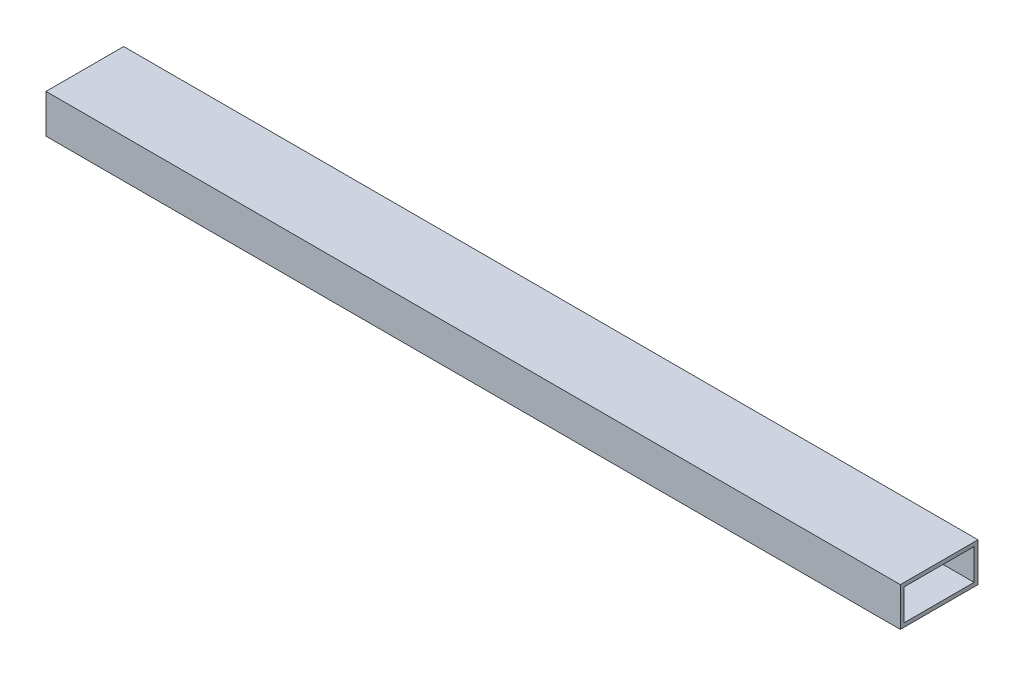
ISO-10303-21;
HEADER;
FILE_DESCRIPTION(('STEP AP214'),'2;1');
FILE_NAME('part.step','',(''),(''),'','','');
FILE_SCHEMA(('AUTOMOTIVE_DESIGN { 1 0 10303 214 1 1 1 1 }'));
ENDSEC;
DATA;
#1=APPLICATION_CONTEXT('core data for automotive mechanical design processes');
#2=APPLICATION_PROTOCOL_DEFINITION('international standard','automotive_design',2000,#1);
#3=PRODUCT_CONTEXT('',#1,'mechanical');
#4=PRODUCT('Part','Part','',(#3));
#5=PRODUCT_RELATED_PRODUCT_CATEGORY('part','',(#4));
#6=PRODUCT_DEFINITION_FORMATION('','',#4);
#7=PRODUCT_DEFINITION_CONTEXT('part definition',#1,'design');
#8=PRODUCT_DEFINITION('design','',#6,#7);
#9=PRODUCT_DEFINITION_SHAPE('','',#8);
#10=(LENGTH_UNIT() NAMED_UNIT(*) SI_UNIT(.MILLI.,.METRE.));
#11=(NAMED_UNIT(*) PLANE_ANGLE_UNIT() SI_UNIT($,.RADIAN.));
#12=(NAMED_UNIT(*) SI_UNIT($,.STERADIAN.) SOLID_ANGLE_UNIT());
#13=UNCERTAINTY_MEASURE_WITH_UNIT(LENGTH_MEASURE(1.E-05),#10,'distance_accuracy_value','');
#14=(GEOMETRIC_REPRESENTATION_CONTEXT(3) GLOBAL_UNCERTAINTY_ASSIGNED_CONTEXT((#13)) GLOBAL_UNIT_ASSIGNED_CONTEXT((#10,
#11,#12)) REPRESENTATION_CONTEXT('',''));
#15=CARTESIAN_POINT('',(0.,0.,0.));
#16=DIRECTION('',(0.,0.,1.));
#17=DIRECTION('',(1.,0.,0.));
#18=AXIS2_PLACEMENT_3D('',#15,#16,#17);
#19=CARTESIAN_POINT('',(-279.4,25.4,25.4));
#20=DIRECTION('',(1.,0.,0.));
#21=DIRECTION('',(0.,0.,-1.));
#22=AXIS2_PLACEMENT_3D('',#19,#20,#21);
#23=PLANE('',#22);
#24=DIRECTION('',(0.,0.,1.));
#25=VECTOR('',#24,1.);
#26=CARTESIAN_POINT('',(-279.4,22.86,-22.86));
#27=LINE('',#26,#25);
#28=CARTESIAN_POINT('',(-279.4,22.86,-22.86));
#29=VERTEX_POINT('',#28);
#30=CARTESIAN_POINT('',(-279.4,22.86,22.86));
#31=VERTEX_POINT('',#30);
#32=EDGE_CURVE('E105',#29,#31,#27,.T.);
#33=ORIENTED_EDGE('',*,*,#32,.T.);
#34=DIRECTION('',(0.,-1.,0.));
#35=VECTOR('',#34,1.);
#36=CARTESIAN_POINT('',(-279.4,2.53999999999999,22.86));
#37=LINE('',#36,#35);
#38=CARTESIAN_POINT('',(-279.4,2.53999999999999,22.86));
#39=VERTEX_POINT('',#38);
#40=EDGE_CURVE('E99',#31,#39,#37,.T.);
#41=ORIENTED_EDGE('',*,*,#40,.T.);
#42=DIRECTION('',(0.,0.,-1.));
#43=VECTOR('',#42,1.);
#44=CARTESIAN_POINT('',(-279.4,2.54,-22.86));
#45=LINE('',#44,#43);
#46=CARTESIAN_POINT('',(-279.4,2.54,-22.86));
#47=VERTEX_POINT('',#46);
#48=EDGE_CURVE('E108',#39,#47,#45,.T.);
#49=ORIENTED_EDGE('',*,*,#48,.T.);
#50=DIRECTION('',(0.,1.,0.));
#51=VECTOR('',#50,1.);
#52=CARTESIAN_POINT('',(-279.4,2.54,-22.86));
#53=LINE('',#52,#51);
#54=EDGE_CURVE('E47',#47,#29,#53,.T.);
#55=ORIENTED_EDGE('',*,*,#54,.T.);
#56=EDGE_LOOP('',(#33,#41,#49,#55));
#57=FACE_BOUND('',#56,.T.);
#58=DIRECTION('',(0.,0.,1.));
#59=VECTOR('',#58,1.);
#60=CARTESIAN_POINT('',(-279.4,0.,25.4));
#61=LINE('',#60,#59);
#62=CARTESIAN_POINT('',(-279.4,0.,-25.4));
#63=VERTEX_POINT('',#62);
#64=CARTESIAN_POINT('',(-279.4,0.,25.4));
#65=VERTEX_POINT('',#64);
#66=EDGE_CURVE('E129',#63,#65,#61,.T.);
#67=ORIENTED_EDGE('',*,*,#66,.T.);
#68=DIRECTION('',(0.,-1.,0.));
#69=VECTOR('',#68,1.);
#70=CARTESIAN_POINT('',(-279.4,25.4,25.4));
#71=LINE('',#70,#69);
#72=CARTESIAN_POINT('',(-279.4,25.4,25.4));
#73=VERTEX_POINT('',#72);
#74=EDGE_CURVE('E11',#73,#65,#71,.T.);
#75=ORIENTED_EDGE('',*,*,#74,.F.);
#76=DIRECTION('',(0.,0.,1.));
#77=VECTOR('',#76,1.);
#78=CARTESIAN_POINT('',(-279.4,25.4,25.4));
#79=LINE('',#78,#77);
#80=CARTESIAN_POINT('',(-279.4,25.4,-25.4));
#81=VERTEX_POINT('',#80);
#82=EDGE_CURVE('E133',#81,#73,#79,.T.);
#83=ORIENTED_EDGE('',*,*,#82,.F.);
#84=DIRECTION('',(0.,-1.,0.));
#85=VECTOR('',#84,1.);
#86=CARTESIAN_POINT('',(-279.4,25.4,-25.4));
#87=LINE('',#86,#85);
#88=EDGE_CURVE('E143',#81,#63,#87,.T.);
#89=ORIENTED_EDGE('',*,*,#88,.T.);
#90=EDGE_LOOP('',(#67,#75,#83,#89));
#91=FACE_BOUND('',#90,.T.);
#92=ADVANCED_FACE('F33',(#57,#91),#23,.F.);
#93=CARTESIAN_POINT('',(279.4,25.4,25.4));
#94=DIRECTION('',(0.,0.,-1.));
#95=DIRECTION('',(-1.,0.,0.));
#96=AXIS2_PLACEMENT_3D('',#93,#94,#95);
#97=PLANE('',#96);
#98=DIRECTION('',(1.,0.,0.));
#99=VECTOR('',#98,1.);
#100=CARTESIAN_POINT('',(279.4,0.,25.4));
#101=LINE('',#100,#99);
#102=CARTESIAN_POINT('',(279.4,0.,25.4));
#103=VERTEX_POINT('',#102);
#104=EDGE_CURVE('E146',#65,#103,#101,.T.);
#105=ORIENTED_EDGE('',*,*,#104,.T.);
#106=DIRECTION('',(0.,-1.,0.));
#107=VECTOR('',#106,1.);
#108=CARTESIAN_POINT('',(279.4,25.4,25.4));
#109=LINE('',#108,#107);
#110=CARTESIAN_POINT('',(279.4,25.4,25.4));
#111=VERTEX_POINT('',#110);
#112=EDGE_CURVE('E40',#111,#103,#109,.T.);
#113=ORIENTED_EDGE('',*,*,#112,.F.);
#114=DIRECTION('',(1.,0.,0.));
#115=VECTOR('',#114,1.);
#116=CARTESIAN_POINT('',(279.4,25.4,25.4));
#117=LINE('',#116,#115);
#118=EDGE_CURVE('E136',#73,#111,#117,.T.);
#119=ORIENTED_EDGE('',*,*,#118,.F.);
#120=ORIENTED_EDGE('',*,*,#74,.T.);
#121=EDGE_LOOP('',(#105,#113,#119,#120));
#122=FACE_BOUND('',#121,.T.);
#123=ADVANCED_FACE('F175',(#122),#97,.F.);
#124=CARTESIAN_POINT('',(279.4,25.4,25.4));
#125=DIRECTION('',(-1.,0.,0.));
#126=DIRECTION('',(0.,0.,1.));
#127=AXIS2_PLACEMENT_3D('',#124,#125,#126);
#128=PLANE('',#127);
#129=DIRECTION('',(0.,0.,-1.));
#130=VECTOR('',#129,1.);
#131=CARTESIAN_POINT('',(279.4,2.54,-22.86));
#132=LINE('',#131,#130);
#133=CARTESIAN_POINT('',(279.4,2.53999999999999,22.86));
#134=VERTEX_POINT('',#133);
#135=CARTESIAN_POINT('',(279.4,2.54,-22.86));
#136=VERTEX_POINT('',#135);
#137=EDGE_CURVE('E123',#134,#136,#132,.T.);
#138=ORIENTED_EDGE('',*,*,#137,.F.);
#139=DIRECTION('',(0.,-1.,0.));
#140=VECTOR('',#139,1.);
#141=CARTESIAN_POINT('',(279.4,2.53999999999999,22.86));
#142=LINE('',#141,#140);
#143=CARTESIAN_POINT('',(279.4,22.86,22.86));
#144=VERTEX_POINT('',#143);
#145=EDGE_CURVE('E55',#144,#134,#142,.T.);
#146=ORIENTED_EDGE('',*,*,#145,.F.);
#147=DIRECTION('',(0.,0.,1.));
#148=VECTOR('',#147,1.);
#149=CARTESIAN_POINT('',(279.4,22.86,-22.86));
#150=LINE('',#149,#148);
#151=CARTESIAN_POINT('',(279.4,22.86,-22.86));
#152=VERTEX_POINT('',#151);
#153=EDGE_CURVE('E114',#152,#144,#150,.T.);
#154=ORIENTED_EDGE('',*,*,#153,.F.);
#155=DIRECTION('',(0.,1.,0.));
#156=VECTOR('',#155,1.);
#157=CARTESIAN_POINT('',(279.4,2.54,-22.86));
#158=LINE('',#157,#156);
#159=EDGE_CURVE('E117',#136,#152,#158,.T.);
#160=ORIENTED_EDGE('',*,*,#159,.F.);
#161=EDGE_LOOP('',(#138,#146,#154,#160));
#162=FACE_BOUND('',#161,.T.);
#163=DIRECTION('',(0.,0.,-1.));
#164=VECTOR('',#163,1.);
#165=CARTESIAN_POINT('',(279.4,0.,25.4));
#166=LINE('',#165,#164);
#167=CARTESIAN_POINT('',(279.4,0.,-25.4));
#168=VERTEX_POINT('',#167);
#169=EDGE_CURVE('E148',#103,#168,#166,.T.);
#170=ORIENTED_EDGE('',*,*,#169,.T.);
#171=DIRECTION('',(0.,-1.,0.));
#172=VECTOR('',#171,1.);
#173=CARTESIAN_POINT('',(279.4,25.4,-25.4));
#174=LINE('',#173,#172);
#175=CARTESIAN_POINT('',(279.4,25.4,-25.4));
#176=VERTEX_POINT('',#175);
#177=EDGE_CURVE('E153',#176,#168,#174,.T.);
#178=ORIENTED_EDGE('',*,*,#177,.F.);
#179=DIRECTION('',(0.,0.,-1.));
#180=VECTOR('',#179,1.);
#181=CARTESIAN_POINT('',(279.4,25.4,25.4));
#182=LINE('',#181,#180);
#183=EDGE_CURVE('E139',#111,#176,#182,.T.);
#184=ORIENTED_EDGE('',*,*,#183,.F.);
#185=ORIENTED_EDGE('',*,*,#112,.T.);
#186=EDGE_LOOP('',(#170,#178,#184,#185));
#187=FACE_BOUND('',#186,.T.);
#188=ADVANCED_FACE('F160',(#162,#187),#128,.F.);
#189=CARTESIAN_POINT('',(279.4,25.4,-25.4));
#190=DIRECTION('',(0.,0.,1.));
#191=DIRECTION('',(1.,0.,0.));
#192=AXIS2_PLACEMENT_3D('',#189,#190,#191);
#193=PLANE('',#192);
#194=DIRECTION('',(-1.,0.,0.));
#195=VECTOR('',#194,1.);
#196=CARTESIAN_POINT('',(279.4,0.,-25.4));
#197=LINE('',#196,#195);
#198=EDGE_CURVE('E137',#168,#63,#197,.T.);
#199=ORIENTED_EDGE('',*,*,#198,.T.);
#200=ORIENTED_EDGE('',*,*,#88,.F.);
#201=DIRECTION('',(-1.,0.,0.));
#202=VECTOR('',#201,1.);
#203=CARTESIAN_POINT('',(279.4,25.4,-25.4));
#204=LINE('',#203,#202);
#205=EDGE_CURVE('E141',#176,#81,#204,.T.);
#206=ORIENTED_EDGE('',*,*,#205,.F.);
#207=ORIENTED_EDGE('',*,*,#177,.T.);
#208=EDGE_LOOP('',(#199,#200,#206,#207));
#209=FACE_BOUND('',#208,.T.);
#210=ADVANCED_FACE('F169',(#209),#193,.F.);
#211=CARTESIAN_POINT('',(0.,25.4,0.));
#212=DIRECTION('',(0.,1.,0.));
#213=DIRECTION('',(0.,0.,1.));
#214=AXIS2_PLACEMENT_3D('',#211,#212,#213);
#215=PLANE('',#214);
#216=ORIENTED_EDGE('',*,*,#82,.T.);
#217=ORIENTED_EDGE('',*,*,#118,.T.);
#218=ORIENTED_EDGE('',*,*,#183,.T.);
#219=ORIENTED_EDGE('',*,*,#205,.T.);
#220=EDGE_LOOP('',(#216,#217,#218,#219));
#221=FACE_BOUND('',#220,.T.);
#222=ADVANCED_FACE('F174',(#221),#215,.T.);
#223=CARTESIAN_POINT('',(0.,0.,0.));
#224=DIRECTION('',(0.,1.,0.));
#225=DIRECTION('',(0.,0.,1.));
#226=AXIS2_PLACEMENT_3D('',#223,#224,#225);
#227=PLANE('',#226);
#228=ORIENTED_EDGE('',*,*,#66,.F.);
#229=ORIENTED_EDGE('',*,*,#198,.F.);
#230=ORIENTED_EDGE('',*,*,#169,.F.);
#231=ORIENTED_EDGE('',*,*,#104,.F.);
#232=EDGE_LOOP('',(#228,#229,#230,#231));
#233=FACE_BOUND('',#232,.T.);
#234=ADVANCED_FACE('F166',(#233),#227,.F.);
#235=CARTESIAN_POINT('',(-279.4,2.53999999999999,22.86));
#236=DIRECTION('',(0.,0.,1.));
#237=DIRECTION('',(1.,0.,0.));
#238=AXIS2_PLACEMENT_3D('',#235,#236,#237);
#239=PLANE('',#238);
#240=ORIENTED_EDGE('',*,*,#145,.T.);
#241=DIRECTION('',(1.,0.,0.));
#242=VECTOR('',#241,1.);
#243=CARTESIAN_POINT('',(-279.4,2.53999999999999,22.86));
#244=LINE('',#243,#242);
#245=EDGE_CURVE('E95',#39,#134,#244,.T.);
#246=ORIENTED_EDGE('',*,*,#245,.F.);
#247=ORIENTED_EDGE('',*,*,#40,.F.);
#248=DIRECTION('',(1.,0.,0.));
#249=VECTOR('',#248,1.);
#250=CARTESIAN_POINT('',(-279.4,22.86,22.86));
#251=LINE('',#250,#249);
#252=EDGE_CURVE('E127',#31,#144,#251,.T.);
#253=ORIENTED_EDGE('',*,*,#252,.T.);
#254=EDGE_LOOP('',(#240,#246,#247,#253));
#255=FACE_BOUND('',#254,.T.);
#256=ADVANCED_FACE('F97',(#255),#239,.F.);
#257=CARTESIAN_POINT('',(-279.4,22.86,-22.86));
#258=DIRECTION('',(0.,1.,0.));
#259=DIRECTION('',(0.,0.,1.));
#260=AXIS2_PLACEMENT_3D('',#257,#258,#259);
#261=PLANE('',#260);
#262=ORIENTED_EDGE('',*,*,#153,.T.);
#263=ORIENTED_EDGE('',*,*,#252,.F.);
#264=ORIENTED_EDGE('',*,*,#32,.F.);
#265=DIRECTION('',(1.,0.,0.));
#266=VECTOR('',#265,1.);
#267=CARTESIAN_POINT('',(-279.4,22.86,-22.86));
#268=LINE('',#267,#266);
#269=EDGE_CURVE('E130',#29,#152,#268,.T.);
#270=ORIENTED_EDGE('',*,*,#269,.T.);
#271=EDGE_LOOP('',(#262,#263,#264,#270));
#272=FACE_BOUND('',#271,.T.);
#273=ADVANCED_FACE('F192',(#272),#261,.F.);
#274=CARTESIAN_POINT('',(-279.4,2.54,-22.86));
#275=DIRECTION('',(0.,0.,-1.));
#276=DIRECTION('',(-1.,0.,0.));
#277=AXIS2_PLACEMENT_3D('',#274,#275,#276);
#278=PLANE('',#277);
#279=ORIENTED_EDGE('',*,*,#159,.T.);
#280=ORIENTED_EDGE('',*,*,#269,.F.);
#281=ORIENTED_EDGE('',*,*,#54,.F.);
#282=DIRECTION('',(1.,0.,0.));
#283=VECTOR('',#282,1.);
#284=CARTESIAN_POINT('',(-279.4,2.54,-22.86));
#285=LINE('',#284,#283);
#286=EDGE_CURVE('E104',#47,#136,#285,.T.);
#287=ORIENTED_EDGE('',*,*,#286,.T.);
#288=EDGE_LOOP('',(#279,#280,#281,#287));
#289=FACE_BOUND('',#288,.T.);
#290=ADVANCED_FACE('F195',(#289),#278,.F.);
#291=CARTESIAN_POINT('',(-279.4,2.54,-22.86));
#292=DIRECTION('',(0.,-1.,0.));
#293=DIRECTION('',(0.,0.,-1.));
#294=AXIS2_PLACEMENT_3D('',#291,#292,#293);
#295=PLANE('',#294);
#296=ORIENTED_EDGE('',*,*,#137,.T.);
#297=ORIENTED_EDGE('',*,*,#286,.F.);
#298=ORIENTED_EDGE('',*,*,#48,.F.);
#299=ORIENTED_EDGE('',*,*,#245,.T.);
#300=EDGE_LOOP('',(#296,#297,#298,#299));
#301=FACE_BOUND('',#300,.T.);
#302=ADVANCED_FACE('F109',(#301),#295,.F.);
#303=CLOSED_SHELL('',(#92,#123,#188,#210,#222,#234,#256,#273,#290,#302));
#304=MANIFOLD_SOLID_BREP('B2',#303);
#305=ADVANCED_BREP_SHAPE_REPRESENTATION('',(#18,#304),#14);
#306=SHAPE_DEFINITION_REPRESENTATION(#9,#305);
ENDSEC;
END-ISO-10303-21;
